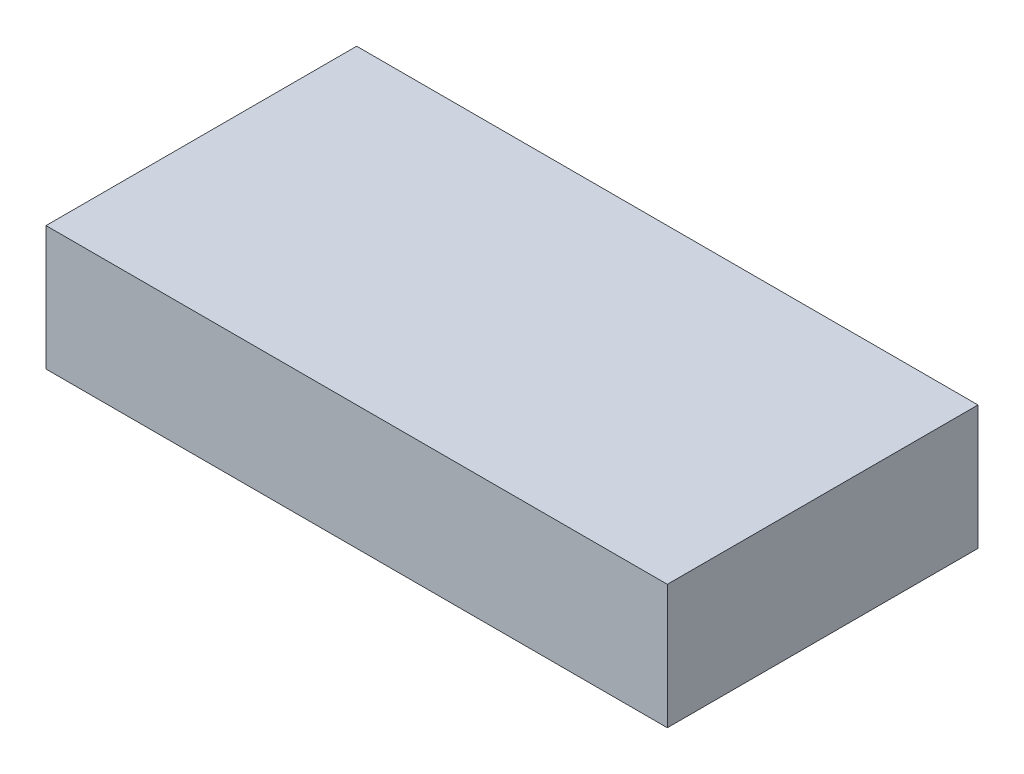
ISO-10303-21;
HEADER;
FILE_DESCRIPTION(('STEP AP214'),'2;1');
FILE_NAME('part.step','',(''),(''),'','','');
FILE_SCHEMA(('AUTOMOTIVE_DESIGN { 1 0 10303 214 1 1 1 1 }'));
ENDSEC;
DATA;
#1=APPLICATION_CONTEXT('core data for automotive mechanical design processes');
#2=APPLICATION_PROTOCOL_DEFINITION('international standard','automotive_design',2000,#1);
#3=PRODUCT_CONTEXT('',#1,'mechanical');
#4=PRODUCT('Part','Part','',(#3));
#5=PRODUCT_RELATED_PRODUCT_CATEGORY('part','',(#4));
#6=PRODUCT_DEFINITION_FORMATION('','',#4);
#7=PRODUCT_DEFINITION_CONTEXT('part definition',#1,'design');
#8=PRODUCT_DEFINITION('design','',#6,#7);
#9=PRODUCT_DEFINITION_SHAPE('','',#8);
#10=(LENGTH_UNIT() NAMED_UNIT(*) SI_UNIT(.MILLI.,.METRE.));
#11=(NAMED_UNIT(*) PLANE_ANGLE_UNIT() SI_UNIT($,.RADIAN.));
#12=(NAMED_UNIT(*) SI_UNIT($,.STERADIAN.) SOLID_ANGLE_UNIT());
#13=UNCERTAINTY_MEASURE_WITH_UNIT(LENGTH_MEASURE(1.E-05),#10,'distance_accuracy_value','');
#14=(GEOMETRIC_REPRESENTATION_CONTEXT(3) GLOBAL_UNCERTAINTY_ASSIGNED_CONTEXT((#13)) GLOBAL_UNIT_ASSIGNED_CONTEXT((#10,
#11,#12)) REPRESENTATION_CONTEXT('',''));
#15=CARTESIAN_POINT('',(0.,0.,0.));
#16=DIRECTION('',(0.,0.,1.));
#17=DIRECTION('',(1.,0.,0.));
#18=AXIS2_PLACEMENT_3D('',#15,#16,#17);
#19=CARTESIAN_POINT('',(0.,2.,0.));
#20=DIRECTION('',(1.,0.,0.));
#21=DIRECTION('',(0.,0.,-1.));
#22=AXIS2_PLACEMENT_3D('',#19,#20,#21);
#23=PLANE('',#22);
#24=DIRECTION('',(0.,0.,1.));
#25=VECTOR('',#24,1.);
#26=CARTESIAN_POINT('',(0.,0.,0.));
#27=LINE('',#26,#25);
#28=CARTESIAN_POINT('',(0.,0.,-5.));
#29=VERTEX_POINT('',#28);
#30=CARTESIAN_POINT('',(0.,0.,0.));
#31=VERTEX_POINT('',#30);
#32=EDGE_CURVE('E96',#29,#31,#27,.T.);
#33=ORIENTED_EDGE('',*,*,#32,.T.);
#34=DIRECTION('',(0.,-1.,0.));
#35=VECTOR('',#34,1.);
#36=CARTESIAN_POINT('',(0.,2.,0.));
#37=LINE('',#36,#35);
#38=CARTESIAN_POINT('',(0.,2.,0.));
#39=VERTEX_POINT('',#38);
#40=EDGE_CURVE('E11',#39,#31,#37,.T.);
#41=ORIENTED_EDGE('',*,*,#40,.F.);
#42=DIRECTION('',(0.,0.,1.));
#43=VECTOR('',#42,1.);
#44=CARTESIAN_POINT('',(0.,2.,0.));
#45=LINE('',#44,#43);
#46=CARTESIAN_POINT('',(0.,2.,-5.));
#47=VERTEX_POINT('',#46);
#48=EDGE_CURVE('E84',#47,#39,#45,.T.);
#49=ORIENTED_EDGE('',*,*,#48,.F.);
#50=DIRECTION('',(0.,-1.,0.));
#51=VECTOR('',#50,1.);
#52=CARTESIAN_POINT('',(0.,2.,-5.));
#53=LINE('',#52,#51);
#54=EDGE_CURVE('E92',#47,#29,#53,.T.);
#55=ORIENTED_EDGE('',*,*,#54,.T.);
#56=EDGE_LOOP('',(#33,#41,#49,#55));
#57=FACE_BOUND('',#56,.T.);
#58=ADVANCED_FACE('F33',(#57),#23,.F.);
#59=CARTESIAN_POINT('',(0.,2.,0.));
#60=DIRECTION('',(0.,0.,-1.));
#61=DIRECTION('',(-1.,0.,0.));
#62=AXIS2_PLACEMENT_3D('',#59,#60,#61);
#63=PLANE('',#62);
#64=DIRECTION('',(1.,0.,0.));
#65=VECTOR('',#64,1.);
#66=CARTESIAN_POINT('',(0.,0.,0.));
#67=LINE('',#66,#65);
#68=CARTESIAN_POINT('',(10.,0.,0.));
#69=VERTEX_POINT('',#68);
#70=EDGE_CURVE('E88',#31,#69,#67,.T.);
#71=ORIENTED_EDGE('',*,*,#70,.T.);
#72=DIRECTION('',(0.,-1.,0.));
#73=VECTOR('',#72,1.);
#74=CARTESIAN_POINT('',(10.,2.,0.));
#75=LINE('',#74,#73);
#76=CARTESIAN_POINT('',(10.,2.,0.));
#77=VERTEX_POINT('',#76);
#78=EDGE_CURVE('E41',#77,#69,#75,.T.);
#79=ORIENTED_EDGE('',*,*,#78,.F.);
#80=DIRECTION('',(1.,0.,0.));
#81=VECTOR('',#80,1.);
#82=CARTESIAN_POINT('',(0.,2.,0.));
#83=LINE('',#82,#81);
#84=EDGE_CURVE('E79',#39,#77,#83,.T.);
#85=ORIENTED_EDGE('',*,*,#84,.F.);
#86=ORIENTED_EDGE('',*,*,#40,.T.);
#87=EDGE_LOOP('',(#71,#79,#85,#86));
#88=FACE_BOUND('',#87,.T.);
#89=ADVANCED_FACE('F87',(#88),#63,.F.);
#90=CARTESIAN_POINT('',(10.,2.,0.));
#91=DIRECTION('',(-1.,0.,0.));
#92=DIRECTION('',(0.,0.,1.));
#93=AXIS2_PLACEMENT_3D('',#90,#91,#92);
#94=PLANE('',#93);
#95=DIRECTION('',(0.,0.,-1.));
#96=VECTOR('',#95,1.);
#97=CARTESIAN_POINT('',(10.,0.,0.));
#98=LINE('',#97,#96);
#99=CARTESIAN_POINT('',(10.,0.,-5.));
#100=VERTEX_POINT('',#99);
#101=EDGE_CURVE('E66',#69,#100,#98,.T.);
#102=ORIENTED_EDGE('',*,*,#101,.T.);
#103=DIRECTION('',(0.,-1.,0.));
#104=VECTOR('',#103,1.);
#105=CARTESIAN_POINT('',(10.,2.,-5.));
#106=LINE('',#105,#104);
#107=CARTESIAN_POINT('',(10.,2.,-5.));
#108=VERTEX_POINT('',#107);
#109=EDGE_CURVE('E89',#108,#100,#106,.T.);
#110=ORIENTED_EDGE('',*,*,#109,.F.);
#111=DIRECTION('',(0.,0.,-1.));
#112=VECTOR('',#111,1.);
#113=CARTESIAN_POINT('',(10.,2.,0.));
#114=LINE('',#113,#112);
#115=EDGE_CURVE('E82',#77,#108,#114,.T.);
#116=ORIENTED_EDGE('',*,*,#115,.F.);
#117=ORIENTED_EDGE('',*,*,#78,.T.);
#118=EDGE_LOOP('',(#102,#110,#116,#117));
#119=FACE_BOUND('',#118,.T.);
#120=ADVANCED_FACE('F90',(#119),#94,.F.);
#121=CARTESIAN_POINT('',(0.,2.,-5.));
#122=DIRECTION('',(0.,0.,1.));
#123=DIRECTION('',(1.,0.,0.));
#124=AXIS2_PLACEMENT_3D('',#121,#122,#123);
#125=PLANE('',#124);
#126=DIRECTION('',(-1.,0.,0.));
#127=VECTOR('',#126,1.);
#128=CARTESIAN_POINT('',(0.,0.,-5.));
#129=LINE('',#128,#127);
#130=EDGE_CURVE('E72',#100,#29,#129,.T.);
#131=ORIENTED_EDGE('',*,*,#130,.T.);
#132=ORIENTED_EDGE('',*,*,#54,.F.);
#133=DIRECTION('',(-1.,0.,0.));
#134=VECTOR('',#133,1.);
#135=CARTESIAN_POINT('',(0.,2.,-5.));
#136=LINE('',#135,#134);
#137=EDGE_CURVE('E49',#108,#47,#136,.T.);
#138=ORIENTED_EDGE('',*,*,#137,.F.);
#139=ORIENTED_EDGE('',*,*,#109,.T.);
#140=EDGE_LOOP('',(#131,#132,#138,#139));
#141=FACE_BOUND('',#140,.T.);
#142=ADVANCED_FACE('F103',(#141),#125,.F.);
#143=CARTESIAN_POINT('',(0.,2.,0.));
#144=DIRECTION('',(0.,-1.,0.));
#145=DIRECTION('',(0.,0.,-1.));
#146=AXIS2_PLACEMENT_3D('',#143,#144,#145);
#147=PLANE('',#146);
#148=ORIENTED_EDGE('',*,*,#48,.T.);
#149=ORIENTED_EDGE('',*,*,#84,.T.);
#150=ORIENTED_EDGE('',*,*,#115,.T.);
#151=ORIENTED_EDGE('',*,*,#137,.T.);
#152=EDGE_LOOP('',(#148,#149,#150,#151));
#153=FACE_BOUND('',#152,.T.);
#154=ADVANCED_FACE('F80',(#153),#147,.F.);
#155=CARTESIAN_POINT('',(0.,0.,0.));
#156=DIRECTION('',(0.,-1.,0.));
#157=DIRECTION('',(0.,0.,-1.));
#158=AXIS2_PLACEMENT_3D('',#155,#156,#157);
#159=PLANE('',#158);
#160=ORIENTED_EDGE('',*,*,#32,.F.);
#161=ORIENTED_EDGE('',*,*,#130,.F.);
#162=ORIENTED_EDGE('',*,*,#101,.F.);
#163=ORIENTED_EDGE('',*,*,#70,.F.);
#164=EDGE_LOOP('',(#160,#161,#162,#163));
#165=FACE_BOUND('',#164,.T.);
#166=ADVANCED_FACE('F106',(#165),#159,.T.);
#167=CLOSED_SHELL('',(#58,#89,#120,#142,#154,#166));
#168=MANIFOLD_SOLID_BREP('B2',#167);
#169=ADVANCED_BREP_SHAPE_REPRESENTATION('',(#18,#168),#14);
#170=SHAPE_DEFINITION_REPRESENTATION(#9,#169);
ENDSEC;
END-ISO-10303-21;
